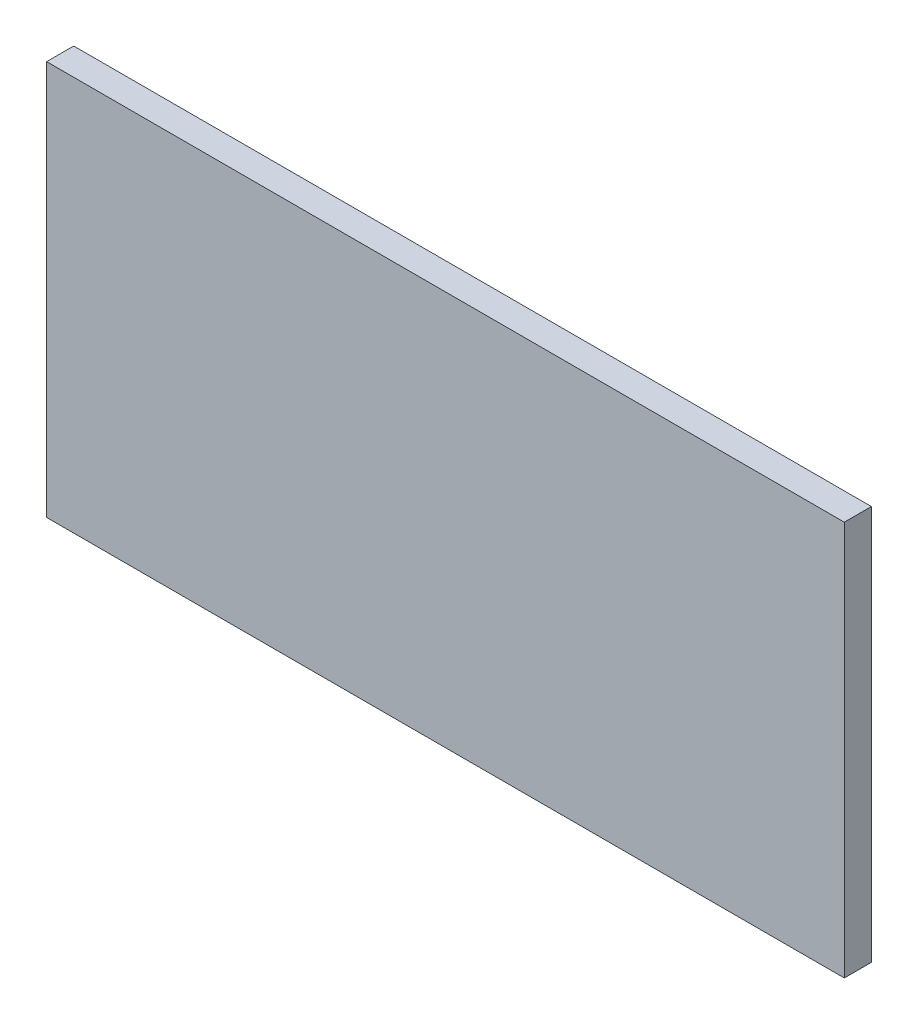
ISO-10303-21;
HEADER;
FILE_DESCRIPTION(('STEP AP214'),'2;1');
FILE_NAME('part.step','',(''),(''),'','','');
FILE_SCHEMA(('AUTOMOTIVE_DESIGN { 1 0 10303 214 1 1 1 1 }'));
ENDSEC;
DATA;
#1=APPLICATION_CONTEXT('core data for automotive mechanical design processes');
#2=APPLICATION_PROTOCOL_DEFINITION('international standard','automotive_design',2000,#1);
#3=PRODUCT_CONTEXT('',#1,'mechanical');
#4=PRODUCT('Part','Part','',(#3));
#5=PRODUCT_RELATED_PRODUCT_CATEGORY('part','',(#4));
#6=PRODUCT_DEFINITION_FORMATION('','',#4);
#7=PRODUCT_DEFINITION_CONTEXT('part definition',#1,'design');
#8=PRODUCT_DEFINITION('design','',#6,#7);
#9=PRODUCT_DEFINITION_SHAPE('','',#8);
#10=(LENGTH_UNIT() NAMED_UNIT(*) SI_UNIT(.MILLI.,.METRE.));
#11=(NAMED_UNIT(*) PLANE_ANGLE_UNIT() SI_UNIT($,.RADIAN.));
#12=(NAMED_UNIT(*) SI_UNIT($,.STERADIAN.) SOLID_ANGLE_UNIT());
#13=UNCERTAINTY_MEASURE_WITH_UNIT(LENGTH_MEASURE(1.E-05),#10,'distance_accuracy_value','');
#14=(GEOMETRIC_REPRESENTATION_CONTEXT(3) GLOBAL_UNCERTAINTY_ASSIGNED_CONTEXT((#13)) GLOBAL_UNIT_ASSIGNED_CONTEXT((#10,
#11,#12)) REPRESENTATION_CONTEXT('',''));
#15=CARTESIAN_POINT('',(0.,0.,0.));
#16=DIRECTION('',(0.,0.,1.));
#17=DIRECTION('',(1.,0.,0.));
#18=AXIS2_PLACEMENT_3D('',#15,#16,#17);
#19=CARTESIAN_POINT('',(-1.473,0.729,0.1));
#20=DIRECTION('',(0.,0.,1.));
#21=DIRECTION('',(1.,0.,0.));
#22=AXIS2_PLACEMENT_3D('',#19,#20,#21);
#23=PLANE('',#22);
#24=DIRECTION('',(0.,1.,0.));
#25=VECTOR('',#24,1.);
#26=CARTESIAN_POINT('',(1.473,0.729,0.1));
#27=LINE('',#26,#25);
#28=CARTESIAN_POINT('',(1.473,0.729,0.1));
#29=VERTEX_POINT('',#28);
#30=CARTESIAN_POINT('',(1.473,-0.729,0.1));
#31=VERTEX_POINT('',#30);
#32=EDGE_CURVE('E53',#29,#31,#27,.F.);
#33=ORIENTED_EDGE('',*,*,#32,.F.);
#34=DIRECTION('',(1.,0.,0.));
#35=VECTOR('',#34,1.);
#36=CARTESIAN_POINT('',(-1.473,0.729,0.1));
#37=LINE('',#36,#35);
#38=CARTESIAN_POINT('',(-1.473,0.729,0.1));
#39=VERTEX_POINT('',#38);
#40=EDGE_CURVE('E68',#39,#29,#37,.T.);
#41=ORIENTED_EDGE('',*,*,#40,.F.);
#42=DIRECTION('',(0.,1.,0.));
#43=VECTOR('',#42,1.);
#44=CARTESIAN_POINT('',(-1.473,-0.729,0.1));
#45=LINE('',#44,#43);
#46=CARTESIAN_POINT('',(-1.473,-0.729,0.1));
#47=VERTEX_POINT('',#46);
#48=EDGE_CURVE('E20',#47,#39,#45,.T.);
#49=ORIENTED_EDGE('',*,*,#48,.F.);
#50=DIRECTION('',(1.,0.,0.));
#51=VECTOR('',#50,1.);
#52=CARTESIAN_POINT('',(1.473,-0.729,0.1));
#53=LINE('',#52,#51);
#54=EDGE_CURVE('E58',#31,#47,#53,.F.);
#55=ORIENTED_EDGE('',*,*,#54,.F.);
#56=EDGE_LOOP('',(#33,#41,#49,#55));
#57=FACE_BOUND('',#56,.T.);
#58=ADVANCED_FACE('F17',(#57),#23,.T.);
#59=CARTESIAN_POINT('',(-1.473,-0.729,0.));
#60=DIRECTION('',(-1.,0.,0.));
#61=DIRECTION('',(0.,0.,1.));
#62=AXIS2_PLACEMENT_3D('',#59,#60,#61);
#63=PLANE('',#62);
#64=DIRECTION('',(0.,0.,1.));
#65=VECTOR('',#64,1.);
#66=CARTESIAN_POINT('',(-1.473,0.729,0.));
#67=LINE('',#66,#65);
#68=CARTESIAN_POINT('',(-1.473,0.729,0.));
#69=VERTEX_POINT('',#68);
#70=EDGE_CURVE('E79',#69,#39,#67,.T.);
#71=ORIENTED_EDGE('',*,*,#70,.F.);
#72=DIRECTION('',(0.,1.,0.));
#73=VECTOR('',#72,1.);
#74=CARTESIAN_POINT('',(-1.473,0.729,0.));
#75=LINE('',#74,#73);
#76=CARTESIAN_POINT('',(-1.473,-0.729,0.));
#77=VERTEX_POINT('',#76);
#78=EDGE_CURVE('E74',#69,#77,#75,.F.);
#79=ORIENTED_EDGE('',*,*,#78,.T.);
#80=DIRECTION('',(0.,0.,-1.));
#81=VECTOR('',#80,1.);
#82=CARTESIAN_POINT('',(-1.473,-0.729,0.));
#83=LINE('',#82,#81);
#84=EDGE_CURVE('E63',#47,#77,#83,.T.);
#85=ORIENTED_EDGE('',*,*,#84,.F.);
#86=ORIENTED_EDGE('',*,*,#48,.T.);
#87=EDGE_LOOP('',(#71,#79,#85,#86));
#88=FACE_BOUND('',#87,.T.);
#89=ADVANCED_FACE('F73',(#88),#63,.T.);
#90=CARTESIAN_POINT('',(1.473,-0.729,0.));
#91=DIRECTION('',(0.,-1.,0.));
#92=DIRECTION('',(0.,0.,-1.));
#93=AXIS2_PLACEMENT_3D('',#90,#91,#92);
#94=PLANE('',#93);
#95=ORIENTED_EDGE('',*,*,#84,.T.);
#96=DIRECTION('',(1.,0.,0.));
#97=VECTOR('',#96,1.);
#98=CARTESIAN_POINT('',(-1.473,-0.729,0.));
#99=LINE('',#98,#97);
#100=CARTESIAN_POINT('',(1.473,-0.729,0.));
#101=VERTEX_POINT('',#100);
#102=EDGE_CURVE('E84',#77,#101,#99,.T.);
#103=ORIENTED_EDGE('',*,*,#102,.T.);
#104=DIRECTION('',(0.,0.,-1.));
#105=VECTOR('',#104,1.);
#106=CARTESIAN_POINT('',(1.473,-0.729,0.));
#107=LINE('',#106,#105);
#108=EDGE_CURVE('E65',#31,#101,#107,.T.);
#109=ORIENTED_EDGE('',*,*,#108,.F.);
#110=ORIENTED_EDGE('',*,*,#54,.T.);
#111=EDGE_LOOP('',(#95,#103,#109,#110));
#112=FACE_BOUND('',#111,.T.);
#113=ADVANCED_FACE('F60',(#112),#94,.T.);
#114=CARTESIAN_POINT('',(1.473,0.729,0.));
#115=DIRECTION('',(1.,0.,0.));
#116=DIRECTION('',(0.,0.,-1.));
#117=AXIS2_PLACEMENT_3D('',#114,#115,#116);
#118=PLANE('',#117);
#119=ORIENTED_EDGE('',*,*,#108,.T.);
#120=DIRECTION('',(0.,1.,0.));
#121=VECTOR('',#120,1.);
#122=CARTESIAN_POINT('',(1.473,0.729,0.));
#123=LINE('',#122,#121);
#124=CARTESIAN_POINT('',(1.473,0.729,0.));
#125=VERTEX_POINT('',#124);
#126=EDGE_CURVE('E26',#101,#125,#123,.T.);
#127=ORIENTED_EDGE('',*,*,#126,.T.);
#128=DIRECTION('',(0.,0.,1.));
#129=VECTOR('',#128,1.);
#130=CARTESIAN_POINT('',(1.473,0.729,0.));
#131=LINE('',#130,#129);
#132=EDGE_CURVE('E34',#29,#125,#131,.F.);
#133=ORIENTED_EDGE('',*,*,#132,.F.);
#134=ORIENTED_EDGE('',*,*,#32,.T.);
#135=EDGE_LOOP('',(#119,#127,#133,#134));
#136=FACE_BOUND('',#135,.T.);
#137=ADVANCED_FACE('F88',(#136),#118,.T.);
#138=CARTESIAN_POINT('',(-1.473,0.729,0.));
#139=DIRECTION('',(0.,1.,0.));
#140=DIRECTION('',(0.,0.,1.));
#141=AXIS2_PLACEMENT_3D('',#138,#139,#140);
#142=PLANE('',#141);
#143=ORIENTED_EDGE('',*,*,#132,.T.);
#144=DIRECTION('',(1.,0.,0.));
#145=VECTOR('',#144,1.);
#146=CARTESIAN_POINT('',(-1.473,0.729,0.));
#147=LINE('',#146,#145);
#148=EDGE_CURVE('E11',#125,#69,#147,.F.);
#149=ORIENTED_EDGE('',*,*,#148,.T.);
#150=ORIENTED_EDGE('',*,*,#70,.T.);
#151=ORIENTED_EDGE('',*,*,#40,.T.);
#152=EDGE_LOOP('',(#143,#149,#150,#151));
#153=FACE_BOUND('',#152,.T.);
#154=ADVANCED_FACE('F91',(#153),#142,.T.);
#155=CARTESIAN_POINT('',(-1.473,0.729,0.));
#156=DIRECTION('',(0.,0.,1.));
#157=DIRECTION('',(1.,0.,0.));
#158=AXIS2_PLACEMENT_3D('',#155,#156,#157);
#159=PLANE('',#158);
#160=ORIENTED_EDGE('',*,*,#126,.F.);
#161=ORIENTED_EDGE('',*,*,#102,.F.);
#162=ORIENTED_EDGE('',*,*,#78,.F.);
#163=ORIENTED_EDGE('',*,*,#148,.F.);
#164=EDGE_LOOP('',(#160,#161,#162,#163));
#165=FACE_BOUND('',#164,.T.);
#166=ADVANCED_FACE('F90',(#165),#159,.F.);
#167=CLOSED_SHELL('',(#58,#89,#113,#137,#154,#166));
#168=MANIFOLD_SOLID_BREP('B1',#167);
#169=ADVANCED_BREP_SHAPE_REPRESENTATION('',(#18,#168),#14);
#170=SHAPE_DEFINITION_REPRESENTATION(#9,#169);
ENDSEC;
END-ISO-10303-21;
